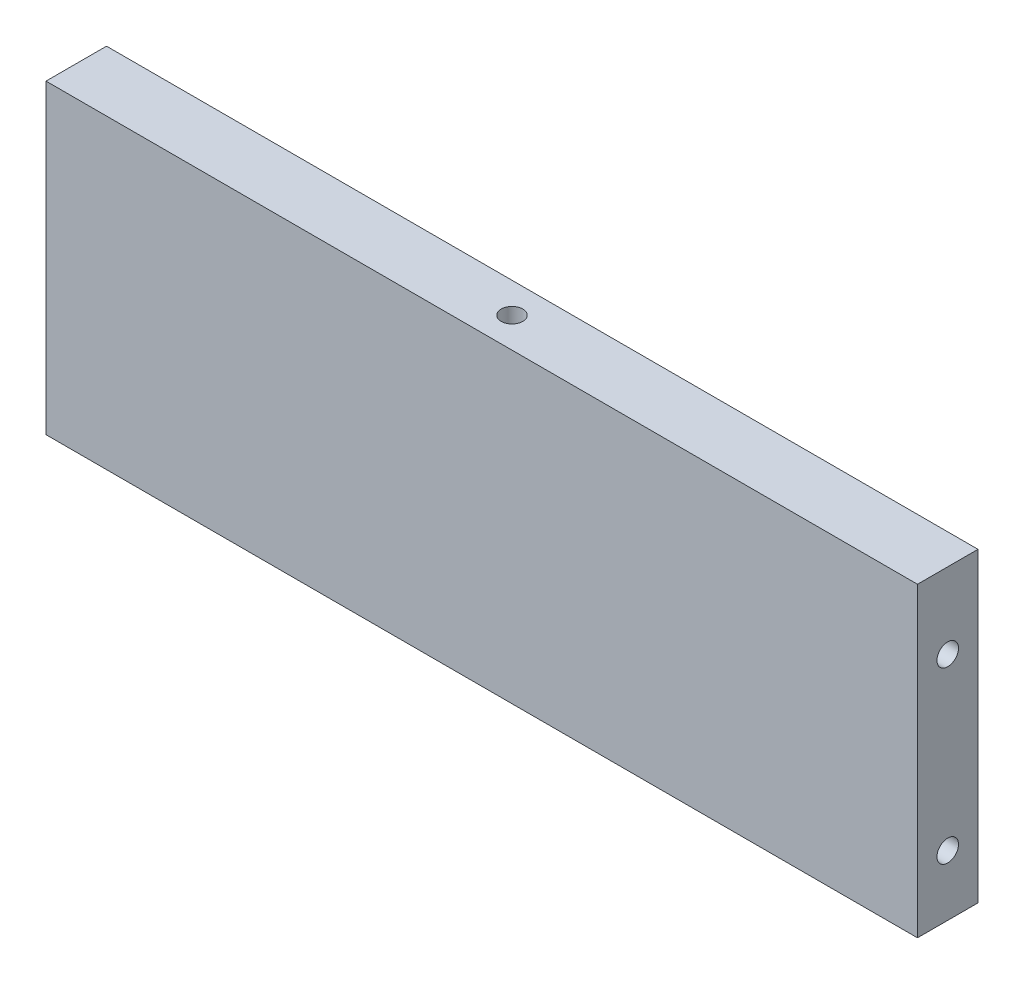
ISO-10303-21;
HEADER;
FILE_DESCRIPTION(('STEP AP214'),'2;1');
FILE_NAME('part.step','',(''),(''),'','','');
FILE_SCHEMA(('AUTOMOTIVE_DESIGN { 1 0 10303 214 1 1 1 1 }'));
ENDSEC;
DATA;
#1=APPLICATION_CONTEXT('core data for automotive mechanical design processes');
#2=APPLICATION_PROTOCOL_DEFINITION('international standard','automotive_design',2000,#1);
#3=PRODUCT_CONTEXT('',#1,'mechanical');
#4=PRODUCT('Part','Part','',(#3));
#5=PRODUCT_RELATED_PRODUCT_CATEGORY('part','',(#4));
#6=PRODUCT_DEFINITION_FORMATION('','',#4);
#7=PRODUCT_DEFINITION_CONTEXT('part definition',#1,'design');
#8=PRODUCT_DEFINITION('design','',#6,#7);
#9=PRODUCT_DEFINITION_SHAPE('','',#8);
#10=(LENGTH_UNIT() NAMED_UNIT(*) SI_UNIT(.MILLI.,.METRE.));
#11=(NAMED_UNIT(*) PLANE_ANGLE_UNIT() SI_UNIT($,.RADIAN.));
#12=(NAMED_UNIT(*) SI_UNIT($,.STERADIAN.) SOLID_ANGLE_UNIT());
#13=UNCERTAINTY_MEASURE_WITH_UNIT(LENGTH_MEASURE(1.E-05),#10,'distance_accuracy_value','');
#14=(GEOMETRIC_REPRESENTATION_CONTEXT(3) GLOBAL_UNCERTAINTY_ASSIGNED_CONTEXT((#13)) GLOBAL_UNIT_ASSIGNED_CONTEXT((#10,
#11,#12)) REPRESENTATION_CONTEXT('',''));
#15=CARTESIAN_POINT('',(0.,0.,0.));
#16=DIRECTION('',(0.,0.,1.));
#17=DIRECTION('',(1.,0.,0.));
#18=AXIS2_PLACEMENT_3D('',#15,#16,#17);
#19=CARTESIAN_POINT('',(-91.44,32.131,6.35));
#20=DIRECTION('',(1.,0.,0.));
#21=DIRECTION('',(0.,0.,-1.));
#22=AXIS2_PLACEMENT_3D('',#19,#20,#21);
#23=PLANE('',#22);
#24=CARTESIAN_POINT('',(-91.44,24.1808000000001,3.175));
#25=DIRECTION('',(1.,0.,0.));
#26=DIRECTION('',(0.,0.,-1.));
#27=AXIS2_PLACEMENT_3D('',#24,#25,#26);
#28=CIRCLE('',#27,1.1303);
#29=CARTESIAN_POINT('',(-91.44,24.1808000000001,2.0447));
#30=VERTEX_POINT('',#29);
#31=EDGE_CURVE('E125',#30,#30,#28,.T.);
#32=ORIENTED_EDGE('',*,*,#31,.T.);
#33=EDGE_LOOP('',(#32));
#34=FACE_BOUND('',#33,.T.);
#35=DIRECTION('',(0.,0.,1.));
#36=VECTOR('',#35,1.);
#37=CARTESIAN_POINT('',(-91.44,0.,6.35));
#38=LINE('',#37,#36);
#39=CARTESIAN_POINT('',(-91.44,0.,0.));
#40=VERTEX_POINT('',#39);
#41=CARTESIAN_POINT('',(-91.44,0.,6.35));
#42=VERTEX_POINT('',#41);
#43=EDGE_CURVE('E69',#40,#42,#38,.T.);
#44=ORIENTED_EDGE('',*,*,#43,.T.);
#45=DIRECTION('',(0.,-1.,0.));
#46=VECTOR('',#45,1.);
#47=CARTESIAN_POINT('',(-91.44,32.131,6.35));
#48=LINE('',#47,#46);
#49=CARTESIAN_POINT('',(-91.44,32.131,6.35));
#50=VERTEX_POINT('',#49);
#51=EDGE_CURVE('E92',#50,#42,#48,.T.);
#52=ORIENTED_EDGE('',*,*,#51,.F.);
#53=DIRECTION('',(0.,0.,1.));
#54=VECTOR('',#53,1.);
#55=CARTESIAN_POINT('',(-91.44,32.131,6.35));
#56=LINE('',#55,#54);
#57=CARTESIAN_POINT('',(-91.44,32.131,0.));
#58=VERTEX_POINT('',#57);
#59=EDGE_CURVE('E85',#58,#50,#56,.T.);
#60=ORIENTED_EDGE('',*,*,#59,.F.);
#61=DIRECTION('',(0.,-1.,0.));
#62=VECTOR('',#61,1.);
#63=CARTESIAN_POINT('',(-91.44,32.131,0.));
#64=LINE('',#63,#62);
#65=EDGE_CURVE('E44',#58,#40,#64,.T.);
#66=ORIENTED_EDGE('',*,*,#65,.T.);
#67=EDGE_LOOP('',(#44,#52,#60,#66));
#68=FACE_BOUND('',#67,.T.);
#69=CARTESIAN_POINT('',(-91.44,6.34999999999995,3.17499999999997));
#70=DIRECTION('',(1.,0.,0.));
#71=DIRECTION('',(0.,0.,-1.));
#72=AXIS2_PLACEMENT_3D('',#69,#70,#71);
#73=CIRCLE('',#72,1.1303);
#74=CARTESIAN_POINT('',(-91.44,6.34999999999995,2.04469999999997));
#75=VERTEX_POINT('',#74);
#76=EDGE_CURVE('E131',#75,#75,#73,.T.);
#77=ORIENTED_EDGE('',*,*,#76,.T.);
#78=EDGE_LOOP('',(#77));
#79=FACE_BOUND('',#78,.T.);
#80=ADVANCED_FACE('F35',(#34,#68,#79),#23,.F.);
#81=CARTESIAN_POINT('',(0.,32.131,6.35));
#82=DIRECTION('',(-1.,0.,0.));
#83=DIRECTION('',(0.,0.,1.));
#84=AXIS2_PLACEMENT_3D('',#81,#82,#83);
#85=PLANE('',#84);
#86=CARTESIAN_POINT('',(0.,6.34999999999995,3.17499999999997));
#87=DIRECTION('',(1.,0.,0.));
#88=DIRECTION('',(0.,0.,-1.));
#89=AXIS2_PLACEMENT_3D('',#86,#87,#88);
#90=CIRCLE('',#89,1.1303);
#91=CARTESIAN_POINT('',(0.,6.34999999999995,2.04469999999997));
#92=VERTEX_POINT('',#91);
#93=EDGE_CURVE('E119',#92,#92,#90,.T.);
#94=ORIENTED_EDGE('',*,*,#93,.F.);
#95=EDGE_LOOP('',(#94));
#96=FACE_BOUND('',#95,.T.);
#97=CARTESIAN_POINT('',(0.,24.1808000000001,3.175));
#98=DIRECTION('',(1.,0.,0.));
#99=DIRECTION('',(0.,0.,-1.));
#100=AXIS2_PLACEMENT_3D('',#97,#98,#99);
#101=CIRCLE('',#100,1.1303);
#102=CARTESIAN_POINT('',(0.,24.1808000000001,2.0447));
#103=VERTEX_POINT('',#102);
#104=EDGE_CURVE('E113',#103,#103,#101,.T.);
#105=ORIENTED_EDGE('',*,*,#104,.F.);
#106=EDGE_LOOP('',(#105));
#107=FACE_BOUND('',#106,.T.);
#108=DIRECTION('',(0.,0.,-1.));
#109=VECTOR('',#108,1.);
#110=CARTESIAN_POINT('',(0.,0.,6.35));
#111=LINE('',#110,#109);
#112=CARTESIAN_POINT('',(0.,0.,6.35));
#113=VERTEX_POINT('',#112);
#114=CARTESIAN_POINT('',(0.,0.,0.));
#115=VERTEX_POINT('',#114);
#116=EDGE_CURVE('E99',#113,#115,#111,.T.);
#117=ORIENTED_EDGE('',*,*,#116,.T.);
#118=DIRECTION('',(0.,-1.,0.));
#119=VECTOR('',#118,1.);
#120=CARTESIAN_POINT('',(0.,32.131,0.));
#121=LINE('',#120,#119);
#122=CARTESIAN_POINT('',(0.,32.131,0.));
#123=VERTEX_POINT('',#122);
#124=EDGE_CURVE('E11',#123,#115,#121,.T.);
#125=ORIENTED_EDGE('',*,*,#124,.F.);
#126=DIRECTION('',(0.,0.,-1.));
#127=VECTOR('',#126,1.);
#128=CARTESIAN_POINT('',(0.,32.131,6.35));
#129=LINE('',#128,#127);
#130=CARTESIAN_POINT('',(0.,32.131,6.35));
#131=VERTEX_POINT('',#130);
#132=EDGE_CURVE('E87',#131,#123,#129,.T.);
#133=ORIENTED_EDGE('',*,*,#132,.F.);
#134=DIRECTION('',(0.,-1.,0.));
#135=VECTOR('',#134,1.);
#136=CARTESIAN_POINT('',(0.,32.131,6.35));
#137=LINE('',#136,#135);
#138=EDGE_CURVE('E95',#131,#113,#137,.T.);
#139=ORIENTED_EDGE('',*,*,#138,.T.);
#140=EDGE_LOOP('',(#117,#125,#133,#139));
#141=FACE_BOUND('',#140,.T.);
#142=ADVANCED_FACE('F37',(#96,#107,#141),#85,.F.);
#143=CARTESIAN_POINT('',(-91.44,32.131,0.));
#144=DIRECTION('',(0.,0.,1.));
#145=DIRECTION('',(1.,0.,0.));
#146=AXIS2_PLACEMENT_3D('',#143,#144,#145);
#147=PLANE('',#146);
#148=DIRECTION('',(-1.,0.,0.));
#149=VECTOR('',#148,1.);
#150=CARTESIAN_POINT('',(-91.44,0.,0.));
#151=LINE('',#150,#149);
#152=EDGE_CURVE('E91',#115,#40,#151,.T.);
#153=ORIENTED_EDGE('',*,*,#152,.T.);
#154=ORIENTED_EDGE('',*,*,#65,.F.);
#155=DIRECTION('',(-1.,0.,0.));
#156=VECTOR('',#155,1.);
#157=CARTESIAN_POINT('',(-91.44,32.131,0.));
#158=LINE('',#157,#156);
#159=EDGE_CURVE('E82',#123,#58,#158,.T.);
#160=ORIENTED_EDGE('',*,*,#159,.F.);
#161=ORIENTED_EDGE('',*,*,#124,.T.);
#162=EDGE_LOOP('',(#153,#154,#160,#161));
#163=FACE_BOUND('',#162,.T.);
#164=ADVANCED_FACE('F90',(#163),#147,.F.);
#165=CARTESIAN_POINT('',(-91.44,32.131,6.35));
#166=DIRECTION('',(0.,0.,-1.));
#167=DIRECTION('',(-1.,0.,0.));
#168=AXIS2_PLACEMENT_3D('',#165,#166,#167);
#169=PLANE('',#168);
#170=DIRECTION('',(1.,0.,0.));
#171=VECTOR('',#170,1.);
#172=CARTESIAN_POINT('',(-91.44,0.,6.35));
#173=LINE('',#172,#171);
#174=EDGE_CURVE('E75',#42,#113,#173,.T.);
#175=ORIENTED_EDGE('',*,*,#174,.T.);
#176=ORIENTED_EDGE('',*,*,#138,.F.);
#177=DIRECTION('',(1.,0.,0.));
#178=VECTOR('',#177,1.);
#179=CARTESIAN_POINT('',(-91.44,32.131,6.35));
#180=LINE('',#179,#178);
#181=EDGE_CURVE('E52',#50,#131,#180,.T.);
#182=ORIENTED_EDGE('',*,*,#181,.F.);
#183=ORIENTED_EDGE('',*,*,#51,.T.);
#184=EDGE_LOOP('',(#175,#176,#182,#183));
#185=FACE_BOUND('',#184,.T.);
#186=ADVANCED_FACE('F107',(#185),#169,.F.);
#187=CARTESIAN_POINT('',(0.,32.131,0.));
#188=DIRECTION('',(0.,-1.,0.));
#189=DIRECTION('',(0.,0.,-1.));
#190=AXIS2_PLACEMENT_3D('',#187,#188,#189);
#191=PLANE('',#190);
#192=CARTESIAN_POINT('',(-45.72,32.131,3.175));
#193=DIRECTION('',(0.,1.,0.));
#194=DIRECTION('',(0.,0.,1.));
#195=AXIS2_PLACEMENT_3D('',#192,#193,#194);
#196=CIRCLE('',#195,1.1303);
#197=CARTESIAN_POINT('',(-45.72,32.131,4.3053));
#198=VERTEX_POINT('',#197);
#199=EDGE_CURVE('E137',#198,#198,#196,.T.);
#200=ORIENTED_EDGE('',*,*,#199,.F.);
#201=EDGE_LOOP('',(#200));
#202=FACE_BOUND('',#201,.T.);
#203=ORIENTED_EDGE('',*,*,#132,.T.);
#204=ORIENTED_EDGE('',*,*,#159,.T.);
#205=ORIENTED_EDGE('',*,*,#59,.T.);
#206=ORIENTED_EDGE('',*,*,#181,.T.);
#207=EDGE_LOOP('',(#203,#204,#205,#206));
#208=FACE_BOUND('',#207,.T.);
#209=ADVANCED_FACE('F83',(#202,#208),#191,.F.);
#210=CARTESIAN_POINT('',(0.,0.,0.));
#211=DIRECTION('',(0.,-1.,0.));
#212=DIRECTION('',(0.,0.,-1.));
#213=AXIS2_PLACEMENT_3D('',#210,#211,#212);
#214=PLANE('',#213);
#215=ORIENTED_EDGE('',*,*,#116,.F.);
#216=ORIENTED_EDGE('',*,*,#174,.F.);
#217=ORIENTED_EDGE('',*,*,#43,.F.);
#218=ORIENTED_EDGE('',*,*,#152,.F.);
#219=EDGE_LOOP('',(#215,#216,#217,#218));
#220=FACE_BOUND('',#219,.T.);
#221=ADVANCED_FACE('F110',(#220),#214,.T.);
#222=CARTESIAN_POINT('',(-12.7,24.1808000000001,3.175));
#223=DIRECTION('',(1.,0.,0.));
#224=DIRECTION('',(0.,0.,-1.));
#225=AXIS2_PLACEMENT_3D('',#222,#223,#224);
#226=CYLINDRICAL_SURFACE('',#225,1.1303);
#227=CARTESIAN_POINT('',(-12.7,24.1808000000001,3.175));
#228=DIRECTION('',(1.,0.,0.));
#229=DIRECTION('',(0.,0.,-1.));
#230=AXIS2_PLACEMENT_3D('',#227,#228,#229);
#231=CIRCLE('',#230,1.1303);
#232=CARTESIAN_POINT('',(-12.7,24.1808000000001,2.0447));
#233=VERTEX_POINT('',#232);
#234=EDGE_CURVE('E102',#233,#233,#231,.T.);
#235=ORIENTED_EDGE('',*,*,#234,.F.);
#236=EDGE_LOOP('',(#235));
#237=FACE_BOUND('',#236,.T.);
#238=ORIENTED_EDGE('',*,*,#104,.T.);
#239=EDGE_LOOP('',(#238));
#240=FACE_BOUND('',#239,.T.);
#241=ADVANCED_FACE('F159',(#237,#240),#226,.F.);
#242=CARTESIAN_POINT('',(-12.7,24.1808000000001,3.175));
#243=DIRECTION('',(1.,0.,0.));
#244=DIRECTION('',(0.,0.,-1.));
#245=AXIS2_PLACEMENT_3D('',#242,#243,#244);
#246=PLANE('',#245);
#247=ORIENTED_EDGE('',*,*,#234,.T.);
#248=EDGE_LOOP('',(#247));
#249=FACE_BOUND('',#248,.T.);
#250=ADVANCED_FACE('F203',(#249),#246,.T.);
#251=CARTESIAN_POINT('',(-12.7,6.34999999999995,3.17499999999997));
#252=DIRECTION('',(1.,0.,0.));
#253=DIRECTION('',(0.,0.,-1.));
#254=AXIS2_PLACEMENT_3D('',#251,#252,#253);
#255=CYLINDRICAL_SURFACE('',#254,1.1303);
#256=CARTESIAN_POINT('',(-12.7,6.34999999999995,3.17499999999997));
#257=DIRECTION('',(1.,0.,0.));
#258=DIRECTION('',(0.,0.,-1.));
#259=AXIS2_PLACEMENT_3D('',#256,#257,#258);
#260=CIRCLE('',#259,1.1303);
#261=CARTESIAN_POINT('',(-12.7,6.34999999999995,2.04469999999997));
#262=VERTEX_POINT('',#261);
#263=EDGE_CURVE('E116',#262,#262,#260,.T.);
#264=ORIENTED_EDGE('',*,*,#263,.F.);
#265=EDGE_LOOP('',(#264));
#266=FACE_BOUND('',#265,.T.);
#267=ORIENTED_EDGE('',*,*,#93,.T.);
#268=EDGE_LOOP('',(#267));
#269=FACE_BOUND('',#268,.T.);
#270=ADVANCED_FACE('F210',(#266,#269),#255,.F.);
#271=CARTESIAN_POINT('',(-12.7,6.34999999999995,3.17499999999997));
#272=DIRECTION('',(1.,0.,0.));
#273=DIRECTION('',(0.,0.,-1.));
#274=AXIS2_PLACEMENT_3D('',#271,#272,#273);
#275=PLANE('',#274);
#276=ORIENTED_EDGE('',*,*,#263,.T.);
#277=EDGE_LOOP('',(#276));
#278=FACE_BOUND('',#277,.T.);
#279=ADVANCED_FACE('F218',(#278),#275,.T.);
#280=CARTESIAN_POINT('',(-78.74,24.1808000000001,3.175));
#281=DIRECTION('',(-1.,0.,0.));
#282=DIRECTION('',(0.,0.,1.));
#283=AXIS2_PLACEMENT_3D('',#280,#281,#282);
#284=CYLINDRICAL_SURFACE('',#283,1.1303);
#285=CARTESIAN_POINT('',(-78.74,24.1808000000001,3.175));
#286=DIRECTION('',(1.,0.,0.));
#287=DIRECTION('',(0.,0.,-1.));
#288=AXIS2_PLACEMENT_3D('',#285,#286,#287);
#289=CIRCLE('',#288,1.1303);
#290=CARTESIAN_POINT('',(-78.74,24.1808000000001,2.0447));
#291=VERTEX_POINT('',#290);
#292=EDGE_CURVE('E122',#291,#291,#289,.T.);
#293=ORIENTED_EDGE('',*,*,#292,.T.);
#294=EDGE_LOOP('',(#293));
#295=FACE_BOUND('',#294,.T.);
#296=ORIENTED_EDGE('',*,*,#31,.F.);
#297=EDGE_LOOP('',(#296));
#298=FACE_BOUND('',#297,.T.);
#299=ADVANCED_FACE('F225',(#295,#298),#284,.F.);
#300=CARTESIAN_POINT('',(-78.74,24.1808000000001,3.175));
#301=DIRECTION('',(-1.,0.,0.));
#302=DIRECTION('',(0.,0.,-1.));
#303=AXIS2_PLACEMENT_3D('',#300,#301,#302);
#304=PLANE('',#303);
#305=ORIENTED_EDGE('',*,*,#292,.F.);
#306=EDGE_LOOP('',(#305));
#307=FACE_BOUND('',#306,.T.);
#308=ADVANCED_FACE('F231',(#307),#304,.T.);
#309=CARTESIAN_POINT('',(-78.74,6.34999999999995,3.17499999999997));
#310=DIRECTION('',(-1.,0.,0.));
#311=DIRECTION('',(0.,0.,1.));
#312=AXIS2_PLACEMENT_3D('',#309,#310,#311);
#313=CYLINDRICAL_SURFACE('',#312,1.1303);
#314=CARTESIAN_POINT('',(-78.74,6.34999999999995,3.17499999999997));
#315=DIRECTION('',(1.,0.,0.));
#316=DIRECTION('',(0.,0.,-1.));
#317=AXIS2_PLACEMENT_3D('',#314,#315,#316);
#318=CIRCLE('',#317,1.1303);
#319=CARTESIAN_POINT('',(-78.74,6.34999999999995,2.04469999999997));
#320=VERTEX_POINT('',#319);
#321=EDGE_CURVE('E128',#320,#320,#318,.T.);
#322=ORIENTED_EDGE('',*,*,#321,.T.);
#323=EDGE_LOOP('',(#322));
#324=FACE_BOUND('',#323,.T.);
#325=ORIENTED_EDGE('',*,*,#76,.F.);
#326=EDGE_LOOP('',(#325));
#327=FACE_BOUND('',#326,.T.);
#328=ADVANCED_FACE('F238',(#324,#327),#313,.F.);
#329=CARTESIAN_POINT('',(-78.74,6.34999999999995,3.17499999999997));
#330=DIRECTION('',(-1.,0.,0.));
#331=DIRECTION('',(0.,0.,-1.));
#332=AXIS2_PLACEMENT_3D('',#329,#330,#331);
#333=PLANE('',#332);
#334=ORIENTED_EDGE('',*,*,#321,.F.);
#335=EDGE_LOOP('',(#334));
#336=FACE_BOUND('',#335,.T.);
#337=ADVANCED_FACE('F148',(#336),#333,.T.);
#338=CARTESIAN_POINT('',(-45.72,19.431,3.175));
#339=DIRECTION('',(0.,1.,0.));
#340=DIRECTION('',(0.,0.,1.));
#341=AXIS2_PLACEMENT_3D('',#338,#339,#340);
#342=CYLINDRICAL_SURFACE('',#341,1.1303);
#343=CARTESIAN_POINT('',(-45.72,19.431,3.175));
#344=DIRECTION('',(0.,1.,0.));
#345=DIRECTION('',(0.,0.,1.));
#346=AXIS2_PLACEMENT_3D('',#343,#344,#345);
#347=CIRCLE('',#346,1.1303);
#348=CARTESIAN_POINT('',(-45.72,19.431,4.3053));
#349=VERTEX_POINT('',#348);
#350=EDGE_CURVE('E134',#349,#349,#347,.T.);
#351=ORIENTED_EDGE('',*,*,#350,.F.);
#352=EDGE_LOOP('',(#351));
#353=FACE_BOUND('',#352,.T.);
#354=ORIENTED_EDGE('',*,*,#199,.T.);
#355=EDGE_LOOP('',(#354));
#356=FACE_BOUND('',#355,.T.);
#357=ADVANCED_FACE('F145',(#353,#356),#342,.F.);
#358=CARTESIAN_POINT('',(-45.72,19.431,3.175));
#359=DIRECTION('',(0.,1.,0.));
#360=DIRECTION('',(0.,0.,1.));
#361=AXIS2_PLACEMENT_3D('',#358,#359,#360);
#362=PLANE('',#361);
#363=ORIENTED_EDGE('',*,*,#350,.T.);
#364=EDGE_LOOP('',(#363));
#365=FACE_BOUND('',#364,.T.);
#366=ADVANCED_FACE('F143',(#365),#362,.T.);
#367=CLOSED_SHELL('',(#80,#142,#164,#186,#209,#221,#241,#250,#270,#279,#299,#308,#328,#337,#357,#366));
#368=MANIFOLD_SOLID_BREP('B2',#367);
#369=ADVANCED_BREP_SHAPE_REPRESENTATION('',(#18,#368),#14);
#370=SHAPE_DEFINITION_REPRESENTATION(#9,#369);
ENDSEC;
END-ISO-10303-21;
